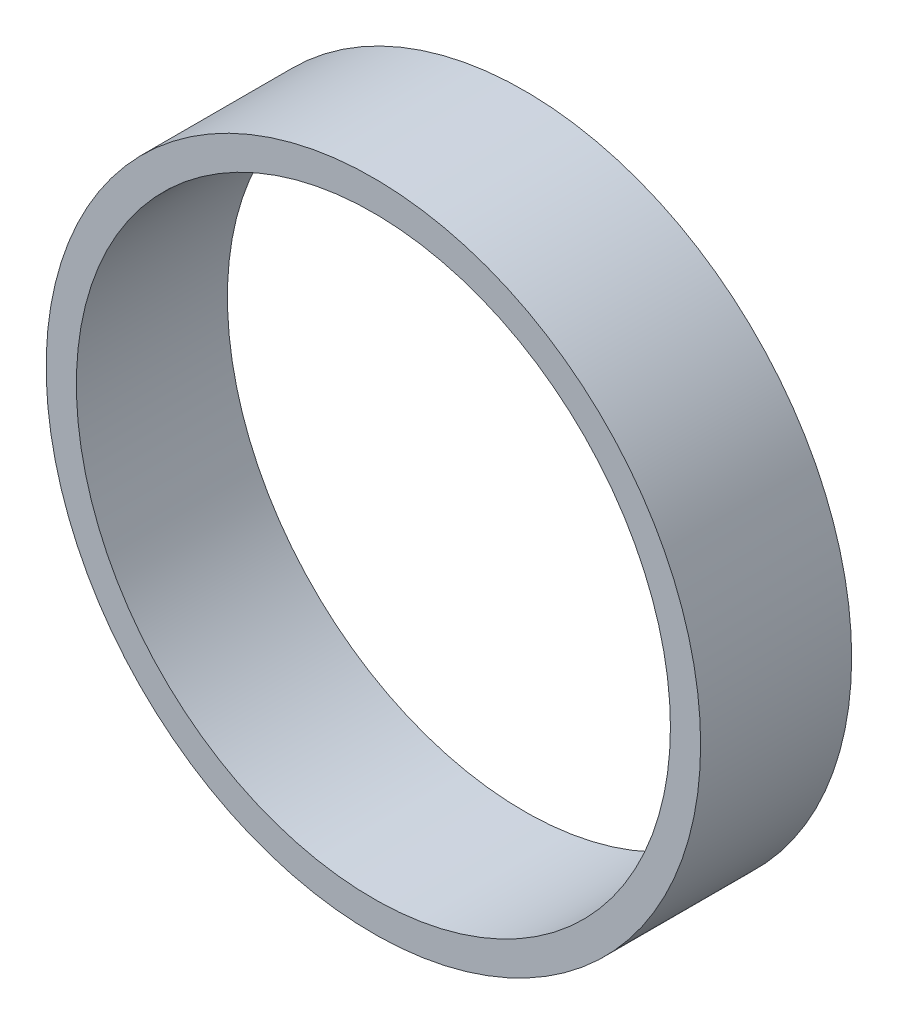
ISO-10303-21;
HEADER;
FILE_DESCRIPTION(('STEP AP214'),'2;1');
FILE_NAME('part.step','',(''),(''),'','','');
FILE_SCHEMA(('AUTOMOTIVE_DESIGN { 1 0 10303 214 1 1 1 1 }'));
ENDSEC;
DATA;
#1=APPLICATION_CONTEXT('core data for automotive mechanical design processes');
#2=APPLICATION_PROTOCOL_DEFINITION('international standard','automotive_design',2000,#1);
#3=PRODUCT_CONTEXT('',#1,'mechanical');
#4=PRODUCT('Part','Part','',(#3));
#5=PRODUCT_RELATED_PRODUCT_CATEGORY('part','',(#4));
#6=PRODUCT_DEFINITION_FORMATION('','',#4);
#7=PRODUCT_DEFINITION_CONTEXT('part definition',#1,'design');
#8=PRODUCT_DEFINITION('design','',#6,#7);
#9=PRODUCT_DEFINITION_SHAPE('','',#8);
#10=(LENGTH_UNIT() NAMED_UNIT(*) SI_UNIT(.MILLI.,.METRE.));
#11=(NAMED_UNIT(*) PLANE_ANGLE_UNIT() SI_UNIT($,.RADIAN.));
#12=(NAMED_UNIT(*) SI_UNIT($,.STERADIAN.) SOLID_ANGLE_UNIT());
#13=UNCERTAINTY_MEASURE_WITH_UNIT(LENGTH_MEASURE(1.E-05),#10,'distance_accuracy_value','');
#14=(GEOMETRIC_REPRESENTATION_CONTEXT(3) GLOBAL_UNCERTAINTY_ASSIGNED_CONTEXT((#13)) GLOBAL_UNIT_ASSIGNED_CONTEXT((#10,
#11,#12)) REPRESENTATION_CONTEXT('',''));
#15=CARTESIAN_POINT('',(0.,0.,0.));
#16=DIRECTION('',(0.,0.,1.));
#17=DIRECTION('',(1.,0.,0.));
#18=AXIS2_PLACEMENT_3D('',#15,#16,#17);
#19=CARTESIAN_POINT('',(0.,0.,15.));
#20=DIRECTION('',(0.,0.,1.));
#21=DIRECTION('',(1.,0.,0.));
#22=AXIS2_PLACEMENT_3D('',#19,#20,#21);
#23=PLANE('',#22);
#24=CARTESIAN_POINT('',(0.,0.,15.));
#25=DIRECTION('',(0.,0.,1.));
#26=DIRECTION('',(1.,0.,0.));
#27=AXIS2_PLACEMENT_3D('',#24,#25,#26);
#28=CIRCLE('',#27,32.5);
#29=CARTESIAN_POINT('',(32.5,0.,15.));
#30=VERTEX_POINT('',#29);
#31=EDGE_CURVE('E10',#30,#30,#28,.T.);
#32=ORIENTED_EDGE('',*,*,#31,.T.);
#33=EDGE_LOOP('',(#32));
#34=FACE_BOUND('',#33,.T.);
#35=CARTESIAN_POINT('',(0.,0.,15.));
#36=DIRECTION('',(0.,0.,1.));
#37=DIRECTION('',(1.,0.,0.));
#38=AXIS2_PLACEMENT_3D('',#35,#36,#37);
#39=CIRCLE('',#38,29.5);
#40=CARTESIAN_POINT('',(29.5,0.,15.));
#41=VERTEX_POINT('',#40);
#42=EDGE_CURVE('E48',#41,#41,#39,.T.);
#43=ORIENTED_EDGE('',*,*,#42,.F.);
#44=EDGE_LOOP('',(#43));
#45=FACE_BOUND('',#44,.T.);
#46=ADVANCED_FACE('F37',(#34,#45),#23,.T.);
#47=CARTESIAN_POINT('',(0.,0.,0.));
#48=DIRECTION('',(0.,0.,1.));
#49=DIRECTION('',(1.,0.,0.));
#50=AXIS2_PLACEMENT_3D('',#47,#48,#49);
#51=PLANE('',#50);
#52=CARTESIAN_POINT('',(0.,0.,0.));
#53=DIRECTION('',(0.,0.,1.));
#54=DIRECTION('',(1.,0.,0.));
#55=AXIS2_PLACEMENT_3D('',#52,#53,#54);
#56=CIRCLE('',#55,32.5);
#57=CARTESIAN_POINT('',(32.5,0.,0.));
#58=VERTEX_POINT('',#57);
#59=EDGE_CURVE('E41',#58,#58,#56,.T.);
#60=ORIENTED_EDGE('',*,*,#59,.F.);
#61=EDGE_LOOP('',(#60));
#62=FACE_BOUND('',#61,.T.);
#63=CARTESIAN_POINT('',(0.,0.,0.));
#64=DIRECTION('',(0.,0.,1.));
#65=DIRECTION('',(1.,0.,0.));
#66=AXIS2_PLACEMENT_3D('',#63,#64,#65);
#67=CIRCLE('',#66,29.5);
#68=CARTESIAN_POINT('',(29.5,0.,0.));
#69=VERTEX_POINT('',#68);
#70=EDGE_CURVE('E50',#69,#69,#67,.T.);
#71=ORIENTED_EDGE('',*,*,#70,.T.);
#72=EDGE_LOOP('',(#71));
#73=FACE_BOUND('',#72,.T.);
#74=ADVANCED_FACE('F60',(#62,#73),#51,.F.);
#75=CARTESIAN_POINT('',(0.,0.,15.));
#76=DIRECTION('',(0.,0.,-1.));
#77=DIRECTION('',(-1.,0.,0.));
#78=AXIS2_PLACEMENT_3D('',#75,#76,#77);
#79=CYLINDRICAL_SURFACE('',#78,32.5);
#80=ORIENTED_EDGE('',*,*,#31,.F.);
#81=EDGE_LOOP('',(#80));
#82=FACE_BOUND('',#81,.T.);
#83=ORIENTED_EDGE('',*,*,#59,.T.);
#84=EDGE_LOOP('',(#83));
#85=FACE_BOUND('',#84,.T.);
#86=ADVANCED_FACE('F39',(#82,#85),#79,.T.);
#87=CARTESIAN_POINT('',(0.,0.,15.));
#88=DIRECTION('',(0.,0.,-1.));
#89=DIRECTION('',(-1.,0.,0.));
#90=AXIS2_PLACEMENT_3D('',#87,#88,#89);
#91=CYLINDRICAL_SURFACE('',#90,29.5);
#92=ORIENTED_EDGE('',*,*,#42,.T.);
#93=EDGE_LOOP('',(#92));
#94=FACE_BOUND('',#93,.T.);
#95=ORIENTED_EDGE('',*,*,#70,.F.);
#96=EDGE_LOOP('',(#95));
#97=FACE_BOUND('',#96,.T.);
#98=ADVANCED_FACE('F56',(#94,#97),#91,.F.);
#99=CLOSED_SHELL('',(#46,#74,#86,#98));
#100=MANIFOLD_SOLID_BREP('B2',#99);
#101=ADVANCED_BREP_SHAPE_REPRESENTATION('',(#18,#100),#14);
#102=SHAPE_DEFINITION_REPRESENTATION(#9,#101);
ENDSEC;
END-ISO-10303-21;
